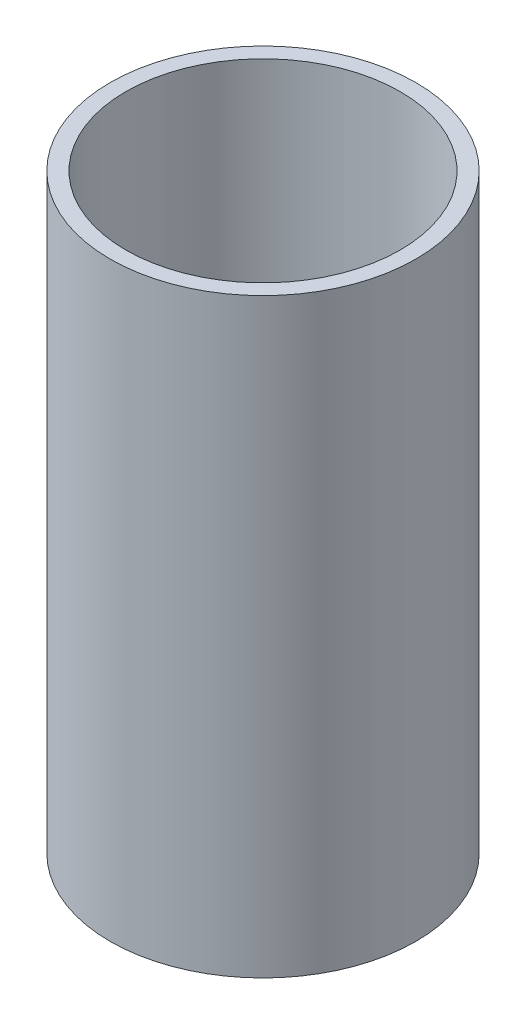
ISO-10303-21;
HEADER;
FILE_DESCRIPTION(('STEP AP214'),'2;1');
FILE_NAME('part.step','',(''),(''),'','','');
FILE_SCHEMA(('AUTOMOTIVE_DESIGN { 1 0 10303 214 1 1 1 1 }'));
ENDSEC;
DATA;
#1=APPLICATION_CONTEXT('core data for automotive mechanical design processes');
#2=APPLICATION_PROTOCOL_DEFINITION('international standard','automotive_design',2000,#1);
#3=PRODUCT_CONTEXT('',#1,'mechanical');
#4=PRODUCT('Part','Part','',(#3));
#5=PRODUCT_RELATED_PRODUCT_CATEGORY('part','',(#4));
#6=PRODUCT_DEFINITION_FORMATION('','',#4);
#7=PRODUCT_DEFINITION_CONTEXT('part definition',#1,'design');
#8=PRODUCT_DEFINITION('design','',#6,#7);
#9=PRODUCT_DEFINITION_SHAPE('','',#8);
#10=(LENGTH_UNIT() NAMED_UNIT(*) SI_UNIT(.MILLI.,.METRE.));
#11=(NAMED_UNIT(*) PLANE_ANGLE_UNIT() SI_UNIT($,.RADIAN.));
#12=(NAMED_UNIT(*) SI_UNIT($,.STERADIAN.) SOLID_ANGLE_UNIT());
#13=UNCERTAINTY_MEASURE_WITH_UNIT(LENGTH_MEASURE(1.E-05),#10,'distance_accuracy_value','');
#14=(GEOMETRIC_REPRESENTATION_CONTEXT(3) GLOBAL_UNCERTAINTY_ASSIGNED_CONTEXT((#13)) GLOBAL_UNIT_ASSIGNED_CONTEXT((#10,
#11,#12)) REPRESENTATION_CONTEXT('',''));
#15=CARTESIAN_POINT('',(0.,0.,0.));
#16=DIRECTION('',(0.,0.,1.));
#17=DIRECTION('',(1.,0.,0.));
#18=AXIS2_PLACEMENT_3D('',#15,#16,#17);
#19=CARTESIAN_POINT('',(0.,164.2949501477,0.));
#20=DIRECTION('',(0.,-1.,0.));
#21=DIRECTION('',(0.,0.,-1.));
#22=AXIS2_PLACEMENT_3D('',#19,#20,#21);
#23=CYLINDRICAL_SURFACE('',#22,42.5);
#24=CARTESIAN_POINT('',(0.,164.2949501477,0.));
#25=DIRECTION('',(0.,1.,0.));
#26=DIRECTION('',(0.,0.,1.));
#27=AXIS2_PLACEMENT_3D('',#24,#25,#26);
#28=CIRCLE('',#27,42.5);
#29=CARTESIAN_POINT('',(0.,164.2949501477,42.5));
#30=VERTEX_POINT('',#29);
#31=EDGE_CURVE('E10',#30,#30,#28,.T.);
#32=ORIENTED_EDGE('',*,*,#31,.F.);
#33=EDGE_LOOP('',(#32));
#34=FACE_BOUND('',#33,.T.);
#35=CARTESIAN_POINT('',(0.,0.,0.));
#36=DIRECTION('',(0.,1.,0.));
#37=DIRECTION('',(0.,0.,1.));
#38=AXIS2_PLACEMENT_3D('',#35,#36,#37);
#39=CIRCLE('',#38,42.5);
#40=CARTESIAN_POINT('',(0.,0.,42.5));
#41=VERTEX_POINT('',#40);
#42=EDGE_CURVE('E37',#41,#41,#39,.T.);
#43=ORIENTED_EDGE('',*,*,#42,.T.);
#44=EDGE_LOOP('',(#43));
#45=FACE_BOUND('',#44,.T.);
#46=ADVANCED_FACE('F40',(#34,#45),#23,.T.);
#47=CARTESIAN_POINT('',(0.,164.2949501477,0.));
#48=DIRECTION('',(0.,1.,0.));
#49=DIRECTION('',(0.,0.,1.));
#50=AXIS2_PLACEMENT_3D('',#47,#48,#49);
#51=PLANE('',#50);
#52=CARTESIAN_POINT('',(0.,164.2949501477,0.));
#53=DIRECTION('',(0.,1.,0.));
#54=DIRECTION('',(0.,0.,1.));
#55=AXIS2_PLACEMENT_3D('',#52,#53,#54);
#56=CIRCLE('',#55,38.1472137793757);
#57=CARTESIAN_POINT('',(0.,164.2949501477,38.1472137793757));
#58=VERTEX_POINT('',#57);
#59=EDGE_CURVE('E50',#58,#58,#56,.T.);
#60=ORIENTED_EDGE('',*,*,#59,.F.);
#61=EDGE_LOOP('',(#60));
#62=FACE_BOUND('',#61,.T.);
#63=ORIENTED_EDGE('',*,*,#31,.T.);
#64=EDGE_LOOP('',(#63));
#65=FACE_BOUND('',#64,.T.);
#66=ADVANCED_FACE('F59',(#62,#65),#51,.T.);
#67=CARTESIAN_POINT('',(0.,0.,0.));
#68=DIRECTION('',(0.,1.,0.));
#69=DIRECTION('',(0.,0.,1.));
#70=AXIS2_PLACEMENT_3D('',#67,#68,#69);
#71=PLANE('',#70);
#72=CARTESIAN_POINT('',(0.,0.,0.));
#73=DIRECTION('',(0.,1.,0.));
#74=DIRECTION('',(0.,0.,1.));
#75=AXIS2_PLACEMENT_3D('',#72,#73,#74);
#76=CIRCLE('',#75,38.1472137793757);
#77=CARTESIAN_POINT('',(0.,0.,38.1472137793757));
#78=VERTEX_POINT('',#77);
#79=EDGE_CURVE('E47',#78,#78,#76,.T.);
#80=ORIENTED_EDGE('',*,*,#79,.T.);
#81=EDGE_LOOP('',(#80));
#82=FACE_BOUND('',#81,.T.);
#83=ORIENTED_EDGE('',*,*,#42,.F.);
#84=EDGE_LOOP('',(#83));
#85=FACE_BOUND('',#84,.T.);
#86=ADVANCED_FACE('F58',(#82,#85),#71,.F.);
#87=CARTESIAN_POINT('',(0.,164.2949501477,0.));
#88=DIRECTION('',(0.,-1.,0.));
#89=DIRECTION('',(0.,0.,-1.));
#90=AXIS2_PLACEMENT_3D('',#87,#88,#89);
#91=CYLINDRICAL_SURFACE('',#90,38.1472137793757);
#92=ORIENTED_EDGE('',*,*,#59,.T.);
#93=EDGE_LOOP('',(#92));
#94=FACE_BOUND('',#93,.T.);
#95=ORIENTED_EDGE('',*,*,#79,.F.);
#96=EDGE_LOOP('',(#95));
#97=FACE_BOUND('',#96,.T.);
#98=ADVANCED_FACE('F54',(#94,#97),#91,.F.);
#99=CLOSED_SHELL('',(#46,#66,#86,#98));
#100=MANIFOLD_SOLID_BREP('B2',#99);
#101=ADVANCED_BREP_SHAPE_REPRESENTATION('',(#18,#100),#14);
#102=SHAPE_DEFINITION_REPRESENTATION(#9,#101);
ENDSEC;
END-ISO-10303-21;
